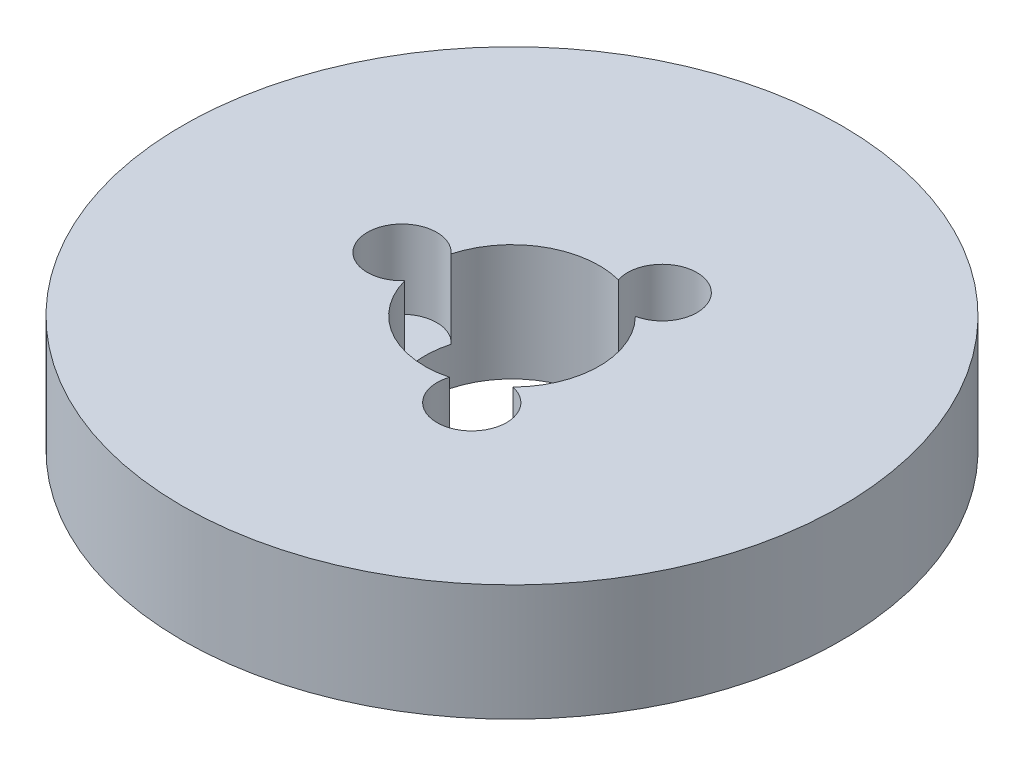
ISO-10303-21;
HEADER;
FILE_DESCRIPTION(('STEP AP214'),'2;1');
FILE_NAME('part.step','',(''),(''),'','','');
FILE_SCHEMA(('AUTOMOTIVE_DESIGN { 1 0 10303 214 1 1 1 1 }'));
ENDSEC;
DATA;
#1=APPLICATION_CONTEXT('core data for automotive mechanical design processes');
#2=APPLICATION_PROTOCOL_DEFINITION('international standard','automotive_design',2000,#1);
#3=PRODUCT_CONTEXT('',#1,'mechanical');
#4=PRODUCT('Part','Part','',(#3));
#5=PRODUCT_RELATED_PRODUCT_CATEGORY('part','',(#4));
#6=PRODUCT_DEFINITION_FORMATION('','',#4);
#7=PRODUCT_DEFINITION_CONTEXT('part definition',#1,'design');
#8=PRODUCT_DEFINITION('design','',#6,#7);
#9=PRODUCT_DEFINITION_SHAPE('','',#8);
#10=(LENGTH_UNIT() NAMED_UNIT(*) SI_UNIT(.MILLI.,.METRE.));
#11=(NAMED_UNIT(*) PLANE_ANGLE_UNIT() SI_UNIT($,.RADIAN.));
#12=(NAMED_UNIT(*) SI_UNIT($,.STERADIAN.) SOLID_ANGLE_UNIT());
#13=UNCERTAINTY_MEASURE_WITH_UNIT(LENGTH_MEASURE(1.E-05),#10,'distance_accuracy_value','');
#14=(GEOMETRIC_REPRESENTATION_CONTEXT(3) GLOBAL_UNCERTAINTY_ASSIGNED_CONTEXT((#13)) GLOBAL_UNIT_ASSIGNED_CONTEXT((#10,
#11,#12)) REPRESENTATION_CONTEXT('',''));
#15=CARTESIAN_POINT('',(0.,0.,0.));
#16=DIRECTION('',(0.,0.,1.));
#17=DIRECTION('',(1.,0.,0.));
#18=AXIS2_PLACEMENT_3D('',#15,#16,#17);
#19=CARTESIAN_POINT('',(0.,30.,0.));
#20=DIRECTION('',(0.,-1.,0.));
#21=DIRECTION('',(0.,0.,-1.));
#22=AXIS2_PLACEMENT_3D('',#19,#20,#21);
#23=CYLINDRICAL_SURFACE('',#22,85.);
#24=CARTESIAN_POINT('',(0.,30.,0.));
#25=DIRECTION('',(0.,1.,0.));
#26=DIRECTION('',(0.,0.,1.));
#27=AXIS2_PLACEMENT_3D('',#24,#25,#26);
#28=CIRCLE('',#27,85.);
#29=CARTESIAN_POINT('',(0.,30.,85.));
#30=VERTEX_POINT('',#29);
#31=EDGE_CURVE('E126',#30,#30,#28,.T.);
#32=ORIENTED_EDGE('',*,*,#31,.F.);
#33=EDGE_LOOP('',(#32));
#34=FACE_BOUND('',#33,.T.);
#35=CARTESIAN_POINT('',(0.,0.,0.));
#36=DIRECTION('',(0.,1.,0.));
#37=DIRECTION('',(0.,0.,1.));
#38=AXIS2_PLACEMENT_3D('',#35,#36,#37);
#39=CIRCLE('',#38,85.);
#40=CARTESIAN_POINT('',(0.,0.,85.));
#41=VERTEX_POINT('',#40);
#42=EDGE_CURVE('E124',#41,#41,#39,.T.);
#43=ORIENTED_EDGE('',*,*,#42,.T.);
#44=EDGE_LOOP('',(#43));
#45=FACE_BOUND('',#44,.T.);
#46=ADVANCED_FACE('F39',(#34,#45),#23,.T.);
#47=CARTESIAN_POINT('',(0.,30.,0.));
#48=DIRECTION('',(0.,1.,0.));
#49=DIRECTION('',(0.,0.,1.));
#50=AXIS2_PLACEMENT_3D('',#47,#48,#49);
#51=PLANE('',#50);
#52=CARTESIAN_POINT('',(14.1812491462426,30.,24.5626440360846));
#53=DIRECTION('',(0.,1.,0.));
#54=DIRECTION('',(0.866025403784436,0.,-0.500000000000004));
#55=AXIS2_PLACEMENT_3D('',#52,#53,#54);
#56=CIRCLE('',#55,8.96370138867963);
#57=CARTESIAN_POINT('',(5.66170224597139,30.,21.776021851522));
#58=VERTEX_POINT('',#57);
#59=CARTESIAN_POINT('',(16.0277369937975,30.,15.7911888994355));
#60=VERTEX_POINT('',#59);
#61=EDGE_CURVE('E147',#58,#60,#56,.T.);
#62=ORIENTED_EDGE('',*,*,#61,.F.);
#63=CARTESIAN_POINT('',(0.,30.,0.));
#64=DIRECTION('',(0.,1.,0.));
#65=DIRECTION('',(0.,0.,1.));
#66=AXIS2_PLACEMENT_3D('',#63,#64,#65);
#67=CIRCLE('',#66,22.5);
#68=CARTESIAN_POINT('',(-21.6894392397687,30.,5.98483295208645));
#69=VERTEX_POINT('',#68);
#70=EDGE_CURVE('E118',#69,#58,#67,.T.);
#71=ORIENTED_EDGE('',*,*,#70,.F.);
#72=CARTESIAN_POINT('',(-28.3624982924849,30.,0.));
#73=DIRECTION('',(0.,1.,0.));
#74=DIRECTION('',(0.,0.,1.));
#75=AXIS2_PLACEMENT_3D('',#72,#73,#74);
#76=CIRCLE('',#75,8.96370138867963);
#77=CARTESIAN_POINT('',(-21.6894392397687,30.,-5.98483295208645));
#78=VERTEX_POINT('',#77);
#79=EDGE_CURVE('E113',#78,#69,#76,.T.);
#80=ORIENTED_EDGE('',*,*,#79,.F.);
#81=CARTESIAN_POINT('',(5.66170224597109,30.,-21.7760218515221));
#82=VERTEX_POINT('',#81);
#83=EDGE_CURVE('E106',#82,#78,#67,.T.);
#84=ORIENTED_EDGE('',*,*,#83,.F.);
#85=CARTESIAN_POINT('',(14.1812491462422,30.,-24.5626440360848));
#86=DIRECTION('',(0.,1.,0.));
#87=DIRECTION('',(-0.866025403784443,0.,-0.499999999999992));
#88=AXIS2_PLACEMENT_3D('',#85,#86,#87);
#89=CIRCLE('',#88,8.96370138867963);
#90=CARTESIAN_POINT('',(16.0277369937973,30.,-15.7911888994357));
#91=VERTEX_POINT('',#90);
#92=EDGE_CURVE('E90',#91,#82,#89,.T.);
#93=ORIENTED_EDGE('',*,*,#92,.F.);
#94=EDGE_CURVE('E116',#60,#91,#67,.T.);
#95=ORIENTED_EDGE('',*,*,#94,.F.);
#96=EDGE_LOOP('',(#62,#71,#80,#84,#93,#95));
#97=FACE_BOUND('',#96,.T.);
#98=ORIENTED_EDGE('',*,*,#31,.T.);
#99=EDGE_LOOP('',(#98));
#100=FACE_BOUND('',#99,.T.);
#101=ADVANCED_FACE('F115',(#97,#100),#51,.T.);
#102=CARTESIAN_POINT('',(0.,0.,0.));
#103=DIRECTION('',(0.,1.,0.));
#104=DIRECTION('',(0.,0.,1.));
#105=AXIS2_PLACEMENT_3D('',#102,#103,#104);
#106=PLANE('',#105);
#107=CARTESIAN_POINT('',(0.,0.,0.));
#108=DIRECTION('',(0.,1.,0.));
#109=DIRECTION('',(0.,0.,1.));
#110=AXIS2_PLACEMENT_3D('',#107,#108,#109);
#111=CIRCLE('',#110,22.5);
#112=CARTESIAN_POINT('',(0.,0.,22.5));
#113=VERTEX_POINT('',#112);
#114=EDGE_CURVE('E120',#113,#113,#111,.T.);
#115=ORIENTED_EDGE('',*,*,#114,.T.);
#116=EDGE_LOOP('',(#115));
#117=FACE_BOUND('',#116,.T.);
#118=ORIENTED_EDGE('',*,*,#42,.F.);
#119=EDGE_LOOP('',(#118));
#120=FACE_BOUND('',#119,.T.);
#121=ADVANCED_FACE('F164',(#117,#120),#106,.F.);
#122=CARTESIAN_POINT('',(0.,30.,0.));
#123=DIRECTION('',(0.,-1.,0.));
#124=DIRECTION('',(0.,0.,-1.));
#125=AXIS2_PLACEMENT_3D('',#122,#123,#124);
#126=CYLINDRICAL_SURFACE('',#125,22.5);
#127=DIRECTION('',(0.,1.,0.));
#128=VECTOR('',#127,1.);
#129=CARTESIAN_POINT('',(5.6617022459714,19.9132501000097,21.776021851522));
#130=LINE('',#129,#128);
#131=CARTESIAN_POINT('',(5.66170224597139,9.82650020001948,21.776021851522));
#132=VERTEX_POINT('',#131);
#133=EDGE_CURVE('E11',#132,#58,#130,.T.);
#134=ORIENTED_EDGE('',*,*,#133,.F.);
#135=CARTESIAN_POINT('',(0.,9.82650020001948,0.));
#136=DIRECTION('',(0.,1.,0.));
#137=DIRECTION('',(0.,0.,1.));
#138=AXIS2_PLACEMENT_3D('',#135,#136,#137);
#139=CIRCLE('',#138,22.5);
#140=CARTESIAN_POINT('',(16.0277369937975,9.82650020001948,15.7911888994355));
#141=VERTEX_POINT('',#140);
#142=EDGE_CURVE('E144',#132,#141,#139,.T.);
#143=ORIENTED_EDGE('',*,*,#142,.T.);
#144=DIRECTION('',(0.,1.,0.));
#145=VECTOR('',#144,1.);
#146=CARTESIAN_POINT('',(16.0277369937975,19.9132501000097,15.7911888994355));
#147=LINE('',#146,#145);
#148=EDGE_CURVE('E46',#60,#141,#147,.F.);
#149=ORIENTED_EDGE('',*,*,#148,.F.);
#150=ORIENTED_EDGE('',*,*,#94,.T.);
#151=DIRECTION('',(0.,1.,0.));
#152=VECTOR('',#151,1.);
#153=CARTESIAN_POINT('',(16.0277369937973,19.9132501000097,-15.7911888994357));
#154=LINE('',#153,#152);
#155=CARTESIAN_POINT('',(16.0277369937973,9.82650020001948,-15.7911888994357));
#156=VERTEX_POINT('',#155);
#157=EDGE_CURVE('E92',#156,#91,#154,.T.);
#158=ORIENTED_EDGE('',*,*,#157,.F.);
#159=CARTESIAN_POINT('',(0.,9.82650020001948,0.));
#160=DIRECTION('',(0.,1.,0.));
#161=DIRECTION('',(0.,0.,1.));
#162=AXIS2_PLACEMENT_3D('',#159,#160,#161);
#163=CIRCLE('',#162,22.5);
#164=CARTESIAN_POINT('',(5.66170224597109,9.82650020001948,-21.7760218515221));
#165=VERTEX_POINT('',#164);
#166=EDGE_CURVE('E107',#156,#165,#163,.T.);
#167=ORIENTED_EDGE('',*,*,#166,.T.);
#168=DIRECTION('',(0.,1.,0.));
#169=VECTOR('',#168,1.);
#170=CARTESIAN_POINT('',(5.66170224597109,19.9132501000097,-21.7760218515221));
#171=LINE('',#170,#169);
#172=EDGE_CURVE('E95',#82,#165,#171,.F.);
#173=ORIENTED_EDGE('',*,*,#172,.F.);
#174=ORIENTED_EDGE('',*,*,#83,.T.);
#175=DIRECTION('',(0.,1.,0.));
#176=VECTOR('',#175,1.);
#177=CARTESIAN_POINT('',(-21.6894392397687,19.9132501000097,-5.98483295208645));
#178=LINE('',#177,#176);
#179=CARTESIAN_POINT('',(-21.6894392397687,9.82650020001948,-5.98483295208645));
#180=VERTEX_POINT('',#179);
#181=EDGE_CURVE('E143',#180,#78,#178,.T.);
#182=ORIENTED_EDGE('',*,*,#181,.F.);
#183=CARTESIAN_POINT('',(0.,9.82650020001948,0.));
#184=DIRECTION('',(0.,1.,0.));
#185=DIRECTION('',(0.,0.,1.));
#186=AXIS2_PLACEMENT_3D('',#183,#184,#185);
#187=CIRCLE('',#186,22.5);
#188=CARTESIAN_POINT('',(-21.6894392397687,9.82650020001948,5.98483295208645));
#189=VERTEX_POINT('',#188);
#190=EDGE_CURVE('E132',#180,#189,#187,.T.);
#191=ORIENTED_EDGE('',*,*,#190,.T.);
#192=DIRECTION('',(0.,1.,0.));
#193=VECTOR('',#192,1.);
#194=CARTESIAN_POINT('',(-21.6894392397687,19.9132501000097,5.98483295208645));
#195=LINE('',#194,#193);
#196=EDGE_CURVE('E137',#69,#189,#195,.F.);
#197=ORIENTED_EDGE('',*,*,#196,.F.);
#198=ORIENTED_EDGE('',*,*,#70,.T.);
#199=EDGE_LOOP('',(#134,#143,#149,#150,#158,#167,#173,#174,#182,#191,#197,#198));
#200=FACE_BOUND('',#199,.T.);
#201=ORIENTED_EDGE('',*,*,#114,.F.);
#202=EDGE_LOOP('',(#201));
#203=FACE_BOUND('',#202,.T.);
#204=ADVANCED_FACE('F103',(#200,#203),#126,.F.);
#205=CARTESIAN_POINT('',(-28.3624982924849,9.82650020001948,0.));
#206=DIRECTION('',(0.,1.,0.));
#207=DIRECTION('',(0.,0.,1.));
#208=AXIS2_PLACEMENT_3D('',#205,#206,#207);
#209=CYLINDRICAL_SURFACE('',#208,8.96370138867963);
#210=ORIENTED_EDGE('',*,*,#181,.T.);
#211=ORIENTED_EDGE('',*,*,#79,.T.);
#212=ORIENTED_EDGE('',*,*,#196,.T.);
#213=CARTESIAN_POINT('',(-28.3624982924849,9.82650020001948,0.));
#214=DIRECTION('',(0.,1.,0.));
#215=DIRECTION('',(0.,0.,1.));
#216=AXIS2_PLACEMENT_3D('',#213,#214,#215);
#217=CIRCLE('',#216,8.96370138867963);
#218=EDGE_CURVE('E121',#180,#189,#217,.T.);
#219=ORIENTED_EDGE('',*,*,#218,.F.);
#220=EDGE_LOOP('',(#210,#211,#212,#219));
#221=FACE_BOUND('',#220,.T.);
#222=ADVANCED_FACE('F174',(#221),#209,.F.);
#223=CARTESIAN_POINT('',(-28.3624982924849,9.82650020001948,0.));
#224=DIRECTION('',(0.,1.,0.));
#225=DIRECTION('',(0.,0.,1.));
#226=AXIS2_PLACEMENT_3D('',#223,#224,#225);
#227=PLANE('',#226);
#228=ORIENTED_EDGE('',*,*,#218,.T.);
#229=ORIENTED_EDGE('',*,*,#190,.F.);
#230=EDGE_LOOP('',(#228,#229));
#231=FACE_BOUND('',#230,.T.);
#232=ADVANCED_FACE('F177',(#231),#227,.T.);
#233=CARTESIAN_POINT('',(14.1812491462422,9.82650020001948,-24.5626440360848));
#234=DIRECTION('',(0.,1.,0.));
#235=DIRECTION('',(0.,0.,1.));
#236=AXIS2_PLACEMENT_3D('',#233,#234,#235);
#237=CYLINDRICAL_SURFACE('',#236,8.96370138867963);
#238=ORIENTED_EDGE('',*,*,#157,.T.);
#239=ORIENTED_EDGE('',*,*,#92,.T.);
#240=ORIENTED_EDGE('',*,*,#172,.T.);
#241=CARTESIAN_POINT('',(14.1812491462422,9.82650020001948,-24.5626440360848));
#242=DIRECTION('',(0.,1.,0.));
#243=DIRECTION('',(-0.866025403784443,0.,-0.499999999999992));
#244=AXIS2_PLACEMENT_3D('',#241,#242,#243);
#245=CIRCLE('',#244,8.96370138867963);
#246=EDGE_CURVE('E56',#156,#165,#245,.T.);
#247=ORIENTED_EDGE('',*,*,#246,.F.);
#248=EDGE_LOOP('',(#238,#239,#240,#247));
#249=FACE_BOUND('',#248,.T.);
#250=ADVANCED_FACE('F93',(#249),#237,.F.);
#251=CARTESIAN_POINT('',(14.1812491462422,9.82650020001948,-24.5626440360848));
#252=DIRECTION('',(0.,1.,0.));
#253=DIRECTION('',(-0.866025403784443,0.,-0.499999999999992));
#254=AXIS2_PLACEMENT_3D('',#251,#252,#253);
#255=PLANE('',#254);
#256=ORIENTED_EDGE('',*,*,#246,.T.);
#257=ORIENTED_EDGE('',*,*,#166,.F.);
#258=EDGE_LOOP('',(#256,#257));
#259=FACE_BOUND('',#258,.T.);
#260=ADVANCED_FACE('F160',(#259),#255,.T.);
#261=CARTESIAN_POINT('',(14.1812491462426,9.82650020001948,24.5626440360846));
#262=DIRECTION('',(0.,1.,0.));
#263=DIRECTION('',(0.,0.,1.));
#264=AXIS2_PLACEMENT_3D('',#261,#262,#263);
#265=CYLINDRICAL_SURFACE('',#264,8.96370138867963);
#266=ORIENTED_EDGE('',*,*,#133,.T.);
#267=ORIENTED_EDGE('',*,*,#61,.T.);
#268=ORIENTED_EDGE('',*,*,#148,.T.);
#269=CARTESIAN_POINT('',(14.1812491462426,9.82650020001948,24.5626440360846));
#270=DIRECTION('',(0.,1.,0.));
#271=DIRECTION('',(0.866025403784436,0.,-0.500000000000004));
#272=AXIS2_PLACEMENT_3D('',#269,#270,#271);
#273=CIRCLE('',#272,8.96370138867963);
#274=EDGE_CURVE('E55',#132,#141,#273,.T.);
#275=ORIENTED_EDGE('',*,*,#274,.F.);
#276=EDGE_LOOP('',(#266,#267,#268,#275));
#277=FACE_BOUND('',#276,.T.);
#278=ADVANCED_FACE('F149',(#277),#265,.F.);
#279=CARTESIAN_POINT('',(14.1812491462426,9.82650020001948,24.5626440360846));
#280=DIRECTION('',(0.,1.,0.));
#281=DIRECTION('',(0.866025403784436,0.,-0.500000000000004));
#282=AXIS2_PLACEMENT_3D('',#279,#280,#281);
#283=PLANE('',#282);
#284=ORIENTED_EDGE('',*,*,#274,.T.);
#285=ORIENTED_EDGE('',*,*,#142,.F.);
#286=EDGE_LOOP('',(#284,#285));
#287=FACE_BOUND('',#286,.T.);
#288=ADVANCED_FACE('F151',(#287),#283,.T.);
#289=CLOSED_SHELL('',(#46,#101,#121,#204,#222,#232,#250,#260,#278,#288));
#290=MANIFOLD_SOLID_BREP('B2',#289);
#291=ADVANCED_BREP_SHAPE_REPRESENTATION('',(#18,#290),#14);
#292=SHAPE_DEFINITION_REPRESENTATION(#9,#291);
ENDSEC;
END-ISO-10303-21;
